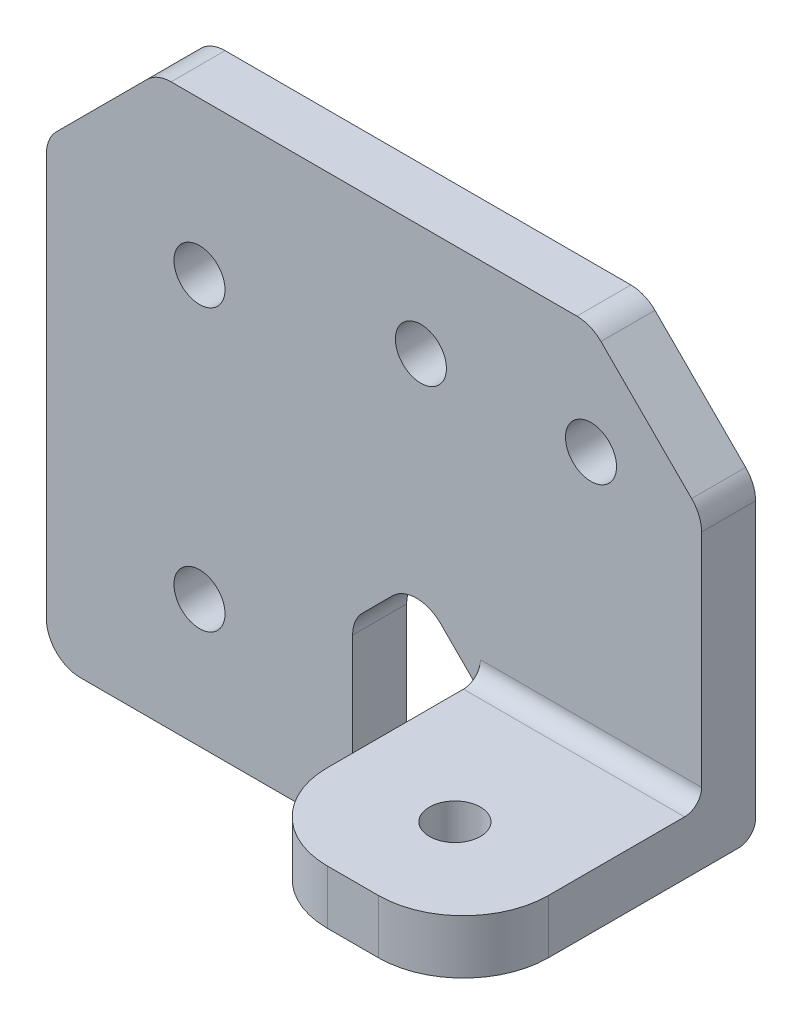
ISO-10303-21;
HEADER;
FILE_DESCRIPTION(('STEP AP214'),'2;1');
FILE_NAME('part.step','',(''),(''),'','','');
FILE_SCHEMA(('AUTOMOTIVE_DESIGN { 1 0 10303 214 1 1 1 1 }'));
ENDSEC;
DATA;
#1=APPLICATION_CONTEXT('core data for automotive mechanical design processes');
#2=APPLICATION_PROTOCOL_DEFINITION('international standard','automotive_design',2000,#1);
#3=PRODUCT_CONTEXT('',#1,'mechanical');
#4=PRODUCT('Part','Part','',(#3));
#5=PRODUCT_RELATED_PRODUCT_CATEGORY('part','',(#4));
#6=PRODUCT_DEFINITION_FORMATION('','',#4);
#7=PRODUCT_DEFINITION_CONTEXT('part definition',#1,'design');
#8=PRODUCT_DEFINITION('design','',#6,#7);
#9=PRODUCT_DEFINITION_SHAPE('','',#8);
#10=(LENGTH_UNIT() NAMED_UNIT(*) SI_UNIT(.MILLI.,.METRE.));
#11=(NAMED_UNIT(*) PLANE_ANGLE_UNIT() SI_UNIT($,.RADIAN.));
#12=(NAMED_UNIT(*) SI_UNIT($,.STERADIAN.) SOLID_ANGLE_UNIT());
#13=UNCERTAINTY_MEASURE_WITH_UNIT(LENGTH_MEASURE(1.E-05),#10,'distance_accuracy_value','');
#14=(GEOMETRIC_REPRESENTATION_CONTEXT(3) GLOBAL_UNCERTAINTY_ASSIGNED_CONTEXT((#13)) GLOBAL_UNIT_ASSIGNED_CONTEXT((#10,
#11,#12)) REPRESENTATION_CONTEXT('',''));
#15=CARTESIAN_POINT('',(0.,0.,0.));
#16=DIRECTION('',(0.,0.,1.));
#17=DIRECTION('',(1.,0.,0.));
#18=AXIS2_PLACEMENT_3D('',#15,#16,#17);
#19=CARTESIAN_POINT('',(6.5,36.,3.175));
#20=DIRECTION('',(1.,0.,0.));
#21=DIRECTION('',(0.,0.,-1.));
#22=AXIS2_PLACEMENT_3D('',#19,#20,#21);
#23=PLANE('',#22);
#24=DIRECTION('',(0.,1.,0.));
#25=VECTOR('',#24,1.);
#26=CARTESIAN_POINT('',(6.5,36.,3.175));
#27=LINE('',#26,#25);
#28=CARTESIAN_POINT('',(6.5,22.175,3.175));
#29=VERTEX_POINT('',#28);
#30=CARTESIAN_POINT('',(6.5,35.1715728752538,3.175));
#31=VERTEX_POINT('',#30);
#32=EDGE_CURVE('E490',#29,#31,#27,.T.);
#33=ORIENTED_EDGE('',*,*,#32,.F.);
#34=CARTESIAN_POINT('',(6.5,22.175,4.175));
#35=DIRECTION('',(-1.,0.,0.));
#36=DIRECTION('',(0.,0.,-1.));
#37=AXIS2_PLACEMENT_3D('',#34,#35,#36);
#38=CIRCLE('',#37,1.);
#39=CARTESIAN_POINT('',(6.5,21.175,4.175));
#40=VERTEX_POINT('',#39);
#41=EDGE_CURVE('E282',#40,#29,#38,.F.);
#42=ORIENTED_EDGE('',*,*,#41,.F.);
#43=DIRECTION('',(0.,0.,-1.));
#44=VECTOR('',#43,1.);
#45=CARTESIAN_POINT('',(6.5,21.175,17.175));
#46=LINE('',#45,#44);
#47=CARTESIAN_POINT('',(6.5,21.175,12.175));
#48=VERTEX_POINT('',#47);
#49=EDGE_CURVE('E479',#48,#40,#46,.T.);
#50=ORIENTED_EDGE('',*,*,#49,.F.);
#51=DIRECTION('',(0.,-1.,0.));
#52=VECTOR('',#51,1.);
#53=CARTESIAN_POINT('',(6.5,36.,12.175));
#54=LINE('',#53,#52);
#55=CARTESIAN_POINT('',(6.5,18.,12.175));
#56=VERTEX_POINT('',#55);
#57=EDGE_CURVE('E257',#56,#48,#54,.F.);
#58=ORIENTED_EDGE('',*,*,#57,.F.);
#59=DIRECTION('',(0.,0.,-1.));
#60=VECTOR('',#59,1.);
#61=CARTESIAN_POINT('',(6.5,18.,3.175));
#62=LINE('',#61,#60);
#63=CARTESIAN_POINT('',(6.5,18.,1.));
#64=VERTEX_POINT('',#63);
#65=EDGE_CURVE('E509',#56,#64,#62,.T.);
#66=ORIENTED_EDGE('',*,*,#65,.T.);
#67=CARTESIAN_POINT('',(6.5,19.,1.));
#68=DIRECTION('',(-1.,0.,0.));
#69=DIRECTION('',(0.,0.,-1.));
#70=AXIS2_PLACEMENT_3D('',#67,#68,#69);
#71=CIRCLE('',#70,1.);
#72=CARTESIAN_POINT('',(6.5,19.,0.));
#73=VERTEX_POINT('',#72);
#74=EDGE_CURVE('E264',#73,#64,#71,.T.);
#75=ORIENTED_EDGE('',*,*,#74,.F.);
#76=DIRECTION('',(0.,1.,0.));
#77=VECTOR('',#76,1.);
#78=CARTESIAN_POINT('',(6.5,36.,0.));
#79=LINE('',#78,#77);
#80=CARTESIAN_POINT('',(6.5,35.1715728752538,0.));
#81=VERTEX_POINT('',#80);
#82=EDGE_CURVE('E499',#73,#81,#79,.T.);
#83=ORIENTED_EDGE('',*,*,#82,.T.);
#84=DIRECTION('',(0.,0.,-1.));
#85=VECTOR('',#84,1.);
#86=CARTESIAN_POINT('',(6.5,35.1715728752538,0.));
#87=LINE('',#86,#85);
#88=EDGE_CURVE('E333',#31,#81,#87,.T.);
#89=ORIENTED_EDGE('',*,*,#88,.F.);
#90=EDGE_LOOP('',(#33,#42,#50,#58,#66,#75,#83,#89));
#91=FACE_BOUND('',#90,.T.);
#92=ADVANCED_FACE('F43',(#91),#23,.T.);
#93=CARTESIAN_POINT('',(0.,18.,3.175));
#94=DIRECTION('',(0.,-1.,0.));
#95=DIRECTION('',(0.,0.,1.));
#96=AXIS2_PLACEMENT_3D('',#93,#94,#95);
#97=PLANE('',#96);
#98=CARTESIAN_POINT('',(0.,18.,11.175));
#99=DIRECTION('',(0.,1.,0.));
#100=DIRECTION('',(0.,0.,1.));
#101=AXIS2_PLACEMENT_3D('',#98,#99,#100);
#102=CIRCLE('',#101,1.5);
#103=CARTESIAN_POINT('',(0.,18.,12.675));
#104=VERTEX_POINT('',#103);
#105=EDGE_CURVE('E470',#104,#104,#102,.T.);
#106=ORIENTED_EDGE('',*,*,#105,.T.);
#107=EDGE_LOOP('',(#106));
#108=FACE_BOUND('',#107,.T.);
#109=ORIENTED_EDGE('',*,*,#65,.F.);
#110=CARTESIAN_POINT('',(1.5,18.,12.175));
#111=DIRECTION('',(0.,1.,0.));
#112=DIRECTION('',(0.,0.,1.));
#113=AXIS2_PLACEMENT_3D('',#110,#111,#112);
#114=CIRCLE('',#113,5.);
#115=CARTESIAN_POINT('',(1.5,18.,17.175));
#116=VERTEX_POINT('',#115);
#117=EDGE_CURVE('E249',#116,#56,#114,.T.);
#118=ORIENTED_EDGE('',*,*,#117,.F.);
#119=DIRECTION('',(-1.,0.,0.));
#120=VECTOR('',#119,1.);
#121=CARTESIAN_POINT('',(-6.5,18.,17.175));
#122=LINE('',#121,#120);
#123=CARTESIAN_POINT('',(-1.5,18.,17.175));
#124=VERTEX_POINT('',#123);
#125=EDGE_CURVE('E237',#116,#124,#122,.T.);
#126=ORIENTED_EDGE('',*,*,#125,.T.);
#127=CARTESIAN_POINT('',(-1.5,18.,12.175));
#128=DIRECTION('',(0.,1.,0.));
#129=DIRECTION('',(0.,0.,1.));
#130=AXIS2_PLACEMENT_3D('',#127,#128,#129);
#131=CIRCLE('',#130,5.);
#132=CARTESIAN_POINT('',(-6.5,18.,12.175));
#133=VERTEX_POINT('',#132);
#134=EDGE_CURVE('E223',#133,#124,#131,.T.);
#135=ORIENTED_EDGE('',*,*,#134,.F.);
#136=DIRECTION('',(0.,0.,-1.));
#137=VECTOR('',#136,1.);
#138=CARTESIAN_POINT('',(-6.5,18.,3.175));
#139=LINE('',#138,#137);
#140=CARTESIAN_POINT('',(-6.5,18.,1.));
#141=VERTEX_POINT('',#140);
#142=EDGE_CURVE('E495',#133,#141,#139,.T.);
#143=ORIENTED_EDGE('',*,*,#142,.T.);
#144=DIRECTION('',(1.,0.,0.));
#145=VECTOR('',#144,1.);
#146=CARTESIAN_POINT('',(-6.5,18.,1.));
#147=LINE('',#146,#145);
#148=EDGE_CURVE('E268',#64,#141,#147,.F.);
#149=ORIENTED_EDGE('',*,*,#148,.F.);
#150=EDGE_LOOP('',(#109,#118,#126,#135,#143,#149));
#151=FACE_BOUND('',#150,.T.);
#152=ADVANCED_FACE('F522',(#108,#151),#97,.T.);
#153=CARTESIAN_POINT('',(0.,36.,3.175));
#154=DIRECTION('',(0.,0.,-1.));
#155=DIRECTION('',(-1.,0.,0.));
#156=AXIS2_PLACEMENT_3D('',#153,#154,#155);
#157=CYLINDRICAL_SURFACE('',#156,1.5);
#158=CARTESIAN_POINT('',(0.,36.,3.175));
#159=DIRECTION('',(0.,0.,-1.));
#160=DIRECTION('',(1.,0.,0.));
#161=AXIS2_PLACEMENT_3D('',#158,#159,#160);
#162=CIRCLE('',#161,1.5);
#163=CARTESIAN_POINT('',(1.5,36.,3.175));
#164=VERTEX_POINT('',#163);
#165=EDGE_CURVE('E486',#164,#164,#162,.T.);
#166=ORIENTED_EDGE('',*,*,#165,.F.);
#167=EDGE_LOOP('',(#166));
#168=FACE_BOUND('',#167,.T.);
#169=CARTESIAN_POINT('',(0.,36.,0.));
#170=DIRECTION('',(0.,0.,-1.));
#171=DIRECTION('',(1.,0.,0.));
#172=AXIS2_PLACEMENT_3D('',#169,#170,#171);
#173=CIRCLE('',#172,1.5);
#174=CARTESIAN_POINT('',(1.5,36.,0.));
#175=VERTEX_POINT('',#174);
#176=EDGE_CURVE('E485',#175,#175,#173,.T.);
#177=ORIENTED_EDGE('',*,*,#176,.T.);
#178=EDGE_LOOP('',(#177));
#179=FACE_BOUND('',#178,.T.);
#180=ADVANCED_FACE('F618',(#168,#179),#157,.F.);
#181=CARTESIAN_POINT('',(-6.5,36.,3.175));
#182=DIRECTION('',(-1.,0.,0.));
#183=DIRECTION('',(0.,0.,1.));
#184=AXIS2_PLACEMENT_3D('',#181,#182,#183);
#185=PLANE('',#184);
#186=DIRECTION('',(0.,-1.,0.));
#187=VECTOR('',#186,1.);
#188=CARTESIAN_POINT('',(-6.5,36.,0.));
#189=LINE('',#188,#187);
#190=CARTESIAN_POINT('',(-6.5,19.6715728752538,0.));
#191=VERTEX_POINT('',#190);
#192=CARTESIAN_POINT('',(-6.5,19.,0.));
#193=VERTEX_POINT('',#192);
#194=EDGE_CURVE('E491',#191,#193,#189,.T.);
#195=ORIENTED_EDGE('',*,*,#194,.T.);
#196=CARTESIAN_POINT('',(-6.5,19.,1.));
#197=DIRECTION('',(1.,0.,0.));
#198=DIRECTION('',(0.,0.,1.));
#199=AXIS2_PLACEMENT_3D('',#196,#197,#198);
#200=CIRCLE('',#199,1.);
#201=EDGE_CURVE('E272',#141,#193,#200,.T.);
#202=ORIENTED_EDGE('',*,*,#201,.F.);
#203=ORIENTED_EDGE('',*,*,#142,.F.);
#204=DIRECTION('',(0.,1.,0.));
#205=VECTOR('',#204,1.);
#206=CARTESIAN_POINT('',(-6.5,36.,12.175));
#207=LINE('',#206,#205);
#208=CARTESIAN_POINT('',(-6.5,21.175,12.175));
#209=VERTEX_POINT('',#208);
#210=EDGE_CURVE('E245',#209,#133,#207,.F.);
#211=ORIENTED_EDGE('',*,*,#210,.F.);
#212=DIRECTION('',(0.,0.,-1.));
#213=VECTOR('',#212,1.);
#214=CARTESIAN_POINT('',(-6.5,21.175,17.175));
#215=LINE('',#214,#213);
#216=CARTESIAN_POINT('',(-6.5,21.175,4.175));
#217=VERTEX_POINT('',#216);
#218=EDGE_CURVE('E242',#209,#217,#215,.T.);
#219=ORIENTED_EDGE('',*,*,#218,.T.);
#220=CARTESIAN_POINT('',(-6.5,22.175,4.175));
#221=DIRECTION('',(1.,0.,0.));
#222=DIRECTION('',(0.,0.,1.));
#223=AXIS2_PLACEMENT_3D('',#220,#221,#222);
#224=CIRCLE('',#223,1.);
#225=CARTESIAN_POINT('',(-6.5,22.175,3.175));
#226=VERTEX_POINT('',#225);
#227=EDGE_CURVE('E286',#226,#217,#224,.F.);
#228=ORIENTED_EDGE('',*,*,#227,.F.);
#229=DIRECTION('',(0.,1.,0.));
#230=VECTOR('',#229,1.);
#231=CARTESIAN_POINT('',(-6.5,36.,3.175));
#232=LINE('',#231,#230);
#233=CARTESIAN_POINT('',(-6.5,19.6715728752538,3.175));
#234=VERTEX_POINT('',#233);
#235=EDGE_CURVE('E290',#234,#226,#232,.T.);
#236=ORIENTED_EDGE('',*,*,#235,.F.);
#237=DIRECTION('',(0.,0.,-1.));
#238=VECTOR('',#237,1.);
#239=CARTESIAN_POINT('',(-6.5,19.6715728752538,3.175));
#240=LINE('',#239,#238);
#241=EDGE_CURVE('E305',#191,#234,#240,.F.);
#242=ORIENTED_EDGE('',*,*,#241,.F.);
#243=EDGE_LOOP('',(#195,#202,#203,#211,#219,#228,#236,#242));
#244=FACE_BOUND('',#243,.T.);
#245=ADVANCED_FACE('F534',(#244),#185,.T.);
#246=CARTESIAN_POINT('',(0.,36.,3.175));
#247=DIRECTION('',(0.,0.,1.));
#248=DIRECTION('',(1.,0.,0.));
#249=AXIS2_PLACEMENT_3D('',#246,#247,#248);
#250=PLANE('',#249);
#251=CARTESIAN_POINT('',(-23.0129229130923,33.5,3.175));
#252=DIRECTION('',(0.,0.,1.));
#253=DIRECTION('',(-1.,0.,0.));
#254=AXIS2_PLACEMENT_3D('',#251,#252,#253);
#255=CIRCLE('',#254,1.5);
#256=CARTESIAN_POINT('',(-24.5129229130923,33.5,3.175));
#257=VERTEX_POINT('',#256);
#258=EDGE_CURVE('E447',#257,#257,#255,.T.);
#259=ORIENTED_EDGE('',*,*,#258,.F.);
#260=EDGE_LOOP('',(#259));
#261=FACE_BOUND('',#260,.T.);
#262=CARTESIAN_POINT('',(-23.0129229130923,17.,3.175));
#263=DIRECTION('',(0.,0.,-1.));
#264=DIRECTION('',(1.,0.,0.));
#265=AXIS2_PLACEMENT_3D('',#262,#263,#264);
#266=CIRCLE('',#265,1.5);
#267=CARTESIAN_POINT('',(-21.5129229130923,17.,3.175));
#268=VERTEX_POINT('',#267);
#269=EDGE_CURVE('E684',#268,#268,#266,.T.);
#270=ORIENTED_EDGE('',*,*,#269,.T.);
#271=EDGE_LOOP('',(#270));
#272=FACE_BOUND('',#271,.T.);
#273=DIRECTION('',(0.,-1.,0.));
#274=VECTOR('',#273,1.);
#275=CARTESIAN_POINT('',(-32.0129229130922,36.,3.175));
#276=LINE('',#275,#274);
#277=CARTESIAN_POINT('',(-32.0129229130922,35.1715728752538,3.175));
#278=VERTEX_POINT('',#277);
#279=CARTESIAN_POINT('',(-32.0129229130922,11.5,3.175));
#280=VERTEX_POINT('',#279);
#281=EDGE_CURVE('E446',#278,#280,#276,.T.);
#282=ORIENTED_EDGE('',*,*,#281,.T.);
#283=CARTESIAN_POINT('',(-30.0129229130922,11.5,3.175));
#284=DIRECTION('',(0.,0.,-1.));
#285=DIRECTION('',(1.,0.,0.));
#286=AXIS2_PLACEMENT_3D('',#283,#284,#285);
#287=CIRCLE('',#286,2.);
#288=CARTESIAN_POINT('',(-30.0129229130922,9.49999999999996,3.175));
#289=VERTEX_POINT('',#288);
#290=EDGE_CURVE('E373',#289,#280,#287,.T.);
#291=ORIENTED_EDGE('',*,*,#290,.F.);
#292=DIRECTION('',(-1.,0.,0.));
#293=VECTOR('',#292,1.);
#294=CARTESIAN_POINT('',(0.,9.49999999999996,3.175));
#295=LINE('',#294,#293);
#296=CARTESIAN_POINT('',(-16.0129229130923,9.49999999999996,3.175));
#297=VERTEX_POINT('',#296);
#298=EDGE_CURVE('E681',#297,#289,#295,.T.);
#299=ORIENTED_EDGE('',*,*,#298,.F.);
#300=CARTESIAN_POINT('',(-16.0129229130923,11.5,3.175));
#301=DIRECTION('',(0.,0.,-1.));
#302=DIRECTION('',(1.,0.,0.));
#303=AXIS2_PLACEMENT_3D('',#300,#301,#302);
#304=CIRCLE('',#303,2.);
#305=CARTESIAN_POINT('',(-14.0129229130923,11.5,3.175));
#306=VERTEX_POINT('',#305);
#307=EDGE_CURVE('E369',#306,#297,#304,.T.);
#308=ORIENTED_EDGE('',*,*,#307,.F.);
#309=DIRECTION('',(0.,-1.,0.));
#310=VECTOR('',#309,1.);
#311=CARTESIAN_POINT('',(-14.0129229130923,36.,3.175));
#312=LINE('',#311,#310);
#313=CARTESIAN_POINT('',(-14.0129229130923,19.6715728752537,3.175));
#314=VERTEX_POINT('',#313);
#315=EDGE_CURVE('E589',#314,#306,#312,.T.);
#316=ORIENTED_EDGE('',*,*,#315,.F.);
#317=CARTESIAN_POINT('',(-12.0129229130923,19.6715728752537,3.175));
#318=DIRECTION('',(0.,0.,-1.));
#319=DIRECTION('',(1.,0.,0.));
#320=AXIS2_PLACEMENT_3D('',#317,#318,#319);
#321=CIRCLE('',#320,2.);
#322=CARTESIAN_POINT('',(-13.4271364754654,21.0857864376268,3.175));
#323=VERTEX_POINT('',#322);
#324=EDGE_CURVE('E396',#323,#314,#321,.F.);
#325=ORIENTED_EDGE('',*,*,#324,.F.);
#326=DIRECTION('',(-0.707106781186551,-0.707106781186544,0.));
#327=VECTOR('',#326,1.);
#328=CARTESIAN_POINT('',(-10.0129229130922,24.5,3.175));
#329=LINE('',#328,#327);
#330=CARTESIAN_POINT('',(-11.6706750189192,22.842247894173,3.175));
#331=VERTEX_POINT('',#330);
#332=EDGE_CURVE('E344',#331,#323,#329,.T.);
#333=ORIENTED_EDGE('',*,*,#332,.F.);
#334=CARTESIAN_POINT('',(-10.2564614565461,21.4280343317999,3.175));
#335=DIRECTION('',(0.,0.,-1.));
#336=DIRECTION('',(1.,0.,0.));
#337=AXIS2_PLACEMENT_3D('',#334,#335,#336);
#338=CIRCLE('',#337,2.);
#339=CARTESIAN_POINT('',(-8.84224789417304,22.842247894173,3.175));
#340=VERTEX_POINT('',#339);
#341=EDGE_CURVE('E400',#340,#331,#338,.F.);
#342=ORIENTED_EDGE('',*,*,#341,.F.);
#343=DIRECTION('',(0.707106781186551,-0.707106781186544,0.));
#344=VECTOR('',#343,1.);
#345=CARTESIAN_POINT('',(-10.5,24.5,3.175));
#346=LINE('',#345,#344);
#347=CARTESIAN_POINT('',(-7.08578643762691,21.0857864376269,3.175));
#348=VERTEX_POINT('',#347);
#349=EDGE_CURVE('E298',#348,#340,#346,.F.);
#350=ORIENTED_EDGE('',*,*,#349,.F.);
#351=CARTESIAN_POINT('',(-8.5,19.6715728752538,3.175));
#352=DIRECTION('',(0.,0.,-1.));
#353=DIRECTION('',(1.,0.,0.));
#354=AXIS2_PLACEMENT_3D('',#351,#352,#353);
#355=CIRCLE('',#354,2.);
#356=EDGE_CURVE('E337',#234,#348,#355,.F.);
#357=ORIENTED_EDGE('',*,*,#356,.F.);
#358=ORIENTED_EDGE('',*,*,#235,.T.);
#359=DIRECTION('',(1.,0.,0.));
#360=VECTOR('',#359,1.);
#361=CARTESIAN_POINT('',(0.,22.175,3.175));
#362=LINE('',#361,#360);
#363=EDGE_CURVE('E279',#29,#226,#362,.F.);
#364=ORIENTED_EDGE('',*,*,#363,.F.);
#365=ORIENTED_EDGE('',*,*,#32,.T.);
#366=CARTESIAN_POINT('',(4.5,35.1715728752538,3.175));
#367=DIRECTION('',(0.,0.,-1.));
#368=DIRECTION('',(1.,0.,0.));
#369=AXIS2_PLACEMENT_3D('',#366,#367,#368);
#370=CIRCLE('',#369,2.);
#371=CARTESIAN_POINT('',(5.9142135623731,36.5857864376269,3.175));
#372=VERTEX_POINT('',#371);
#373=EDGE_CURVE('E326',#372,#31,#370,.T.);
#374=ORIENTED_EDGE('',*,*,#373,.F.);
#375=DIRECTION('',(-0.707106781186548,0.707106781186548,0.));
#376=VECTOR('',#375,1.);
#377=CARTESIAN_POINT('',(3.25,39.25,3.175));
#378=LINE('',#377,#376);
#379=CARTESIAN_POINT('',(0.585786437626904,41.9142135623731,3.175));
#380=VERTEX_POINT('',#379);
#381=EDGE_CURVE('E555',#372,#380,#378,.T.);
#382=ORIENTED_EDGE('',*,*,#381,.T.);
#383=CARTESIAN_POINT('',(-0.82842712474619,40.5,3.175));
#384=DIRECTION('',(0.,0.,-1.));
#385=DIRECTION('',(1.,0.,0.));
#386=AXIS2_PLACEMENT_3D('',#383,#384,#385);
#387=CIRCLE('',#386,2.);
#388=CARTESIAN_POINT('',(-0.82842712474619,42.5,3.175));
#389=VERTEX_POINT('',#388);
#390=EDGE_CURVE('E329',#389,#380,#387,.T.);
#391=ORIENTED_EDGE('',*,*,#390,.F.);
#392=DIRECTION('',(-1.,0.,0.));
#393=VECTOR('',#392,1.);
#394=CARTESIAN_POINT('',(0.,42.5,3.175));
#395=LINE('',#394,#393);
#396=CARTESIAN_POINT('',(-24.6844957883461,42.5,3.175));
#397=VERTEX_POINT('',#396);
#398=EDGE_CURVE('E452',#389,#397,#395,.T.);
#399=ORIENTED_EDGE('',*,*,#398,.T.);
#400=CARTESIAN_POINT('',(-24.6844957883461,40.5,3.175));
#401=DIRECTION('',(0.,0.,-1.));
#402=DIRECTION('',(1.,0.,0.));
#403=AXIS2_PLACEMENT_3D('',#400,#401,#402);
#404=CIRCLE('',#403,2.);
#405=CARTESIAN_POINT('',(-26.0987093507192,41.9142135623731,3.175));
#406=VERTEX_POINT('',#405);
#407=EDGE_CURVE('E419',#406,#397,#404,.T.);
#408=ORIENTED_EDGE('',*,*,#407,.F.);
#409=DIRECTION('',(-0.707106781186547,-0.707106781186548,0.));
#410=VECTOR('',#409,1.);
#411=CARTESIAN_POINT('',(-16.0064614565462,52.0064614565461,3.175));
#412=LINE('',#411,#410);
#413=CARTESIAN_POINT('',(-31.4271364754653,36.5857864376269,3.175));
#414=VERTEX_POINT('',#413);
#415=EDGE_CURVE('E412',#414,#406,#412,.F.);
#416=ORIENTED_EDGE('',*,*,#415,.F.);
#417=CARTESIAN_POINT('',(-30.0129229130922,35.1715728752538,3.175));
#418=DIRECTION('',(0.,0.,-1.));
#419=DIRECTION('',(1.,0.,0.));
#420=AXIS2_PLACEMENT_3D('',#417,#418,#419);
#421=CIRCLE('',#420,2.);
#422=EDGE_CURVE('E422',#278,#414,#421,.T.);
#423=ORIENTED_EDGE('',*,*,#422,.F.);
#424=EDGE_LOOP('',(#282,#291,#299,#308,#316,#325,#333,#342,#350,#357,#358,#364,#365,#374,#382,
#391,#399,#408,#416,#423));
#425=FACE_BOUND('',#424,.T.);
#426=CARTESIAN_POINT('',(-10.,36.,3.175));
#427=DIRECTION('',(0.,0.,-1.));
#428=DIRECTION('',(1.,0.,0.));
#429=AXIS2_PLACEMENT_3D('',#426,#427,#428);
#430=CIRCLE('',#429,1.5);
#431=CARTESIAN_POINT('',(-8.5,36.,3.175));
#432=VERTEX_POINT('',#431);
#433=EDGE_CURVE('E466',#432,#432,#430,.F.);
#434=ORIENTED_EDGE('',*,*,#433,.F.);
#435=EDGE_LOOP('',(#434));
#436=FACE_BOUND('',#435,.T.);
#437=ORIENTED_EDGE('',*,*,#165,.T.);
#438=EDGE_LOOP('',(#437));
#439=FACE_BOUND('',#438,.T.);
#440=ADVANCED_FACE('F552',(#261,#272,#425,#436,#439),#250,.T.);
#441=CARTESIAN_POINT('',(0.,36.,0.));
#442=DIRECTION('',(0.,0.,1.));
#443=DIRECTION('',(1.,0.,0.));
#444=AXIS2_PLACEMENT_3D('',#441,#442,#443);
#445=PLANE('',#444);
#446=CARTESIAN_POINT('',(-23.0129229130923,33.5,0.));
#447=DIRECTION('',(0.,0.,1.));
#448=DIRECTION('',(-1.,0.,0.));
#449=AXIS2_PLACEMENT_3D('',#446,#447,#448);
#450=CIRCLE('',#449,1.5);
#451=CARTESIAN_POINT('',(-24.5129229130923,33.5,0.));
#452=VERTEX_POINT('',#451);
#453=EDGE_CURVE('E455',#452,#452,#450,.T.);
#454=ORIENTED_EDGE('',*,*,#453,.T.);
#455=EDGE_LOOP('',(#454));
#456=FACE_BOUND('',#455,.T.);
#457=CARTESIAN_POINT('',(-23.0129229130923,17.,0.));
#458=DIRECTION('',(0.,0.,1.));
#459=DIRECTION('',(-1.,0.,0.));
#460=AXIS2_PLACEMENT_3D('',#457,#458,#459);
#461=CIRCLE('',#460,1.5);
#462=CARTESIAN_POINT('',(-24.5129229130923,17.,0.));
#463=VERTEX_POINT('',#462);
#464=EDGE_CURVE('E689',#463,#463,#461,.T.);
#465=ORIENTED_EDGE('',*,*,#464,.T.);
#466=EDGE_LOOP('',(#465));
#467=FACE_BOUND('',#466,.T.);
#468=DIRECTION('',(0.707106781186547,0.707106781186548,0.));
#469=VECTOR('',#468,1.);
#470=CARTESIAN_POINT('',(-25.5129229130923,42.5,0.));
#471=LINE('',#470,#469);
#472=CARTESIAN_POINT('',(-26.0987093507192,41.9142135623731,0.));
#473=VERTEX_POINT('',#472);
#474=CARTESIAN_POINT('',(-31.4271364754653,36.5857864376269,0.));
#475=VERTEX_POINT('',#474);
#476=EDGE_CURVE('E408',#473,#475,#471,.F.);
#477=ORIENTED_EDGE('',*,*,#476,.F.);
#478=CARTESIAN_POINT('',(-24.6844957883461,40.5,0.));
#479=DIRECTION('',(0.,0.,-1.));
#480=DIRECTION('',(1.,0.,0.));
#481=AXIS2_PLACEMENT_3D('',#478,#479,#480);
#482=CIRCLE('',#481,2.);
#483=CARTESIAN_POINT('',(-24.6844957883461,42.5,0.));
#484=VERTEX_POINT('',#483);
#485=EDGE_CURVE('E430',#484,#473,#482,.F.);
#486=ORIENTED_EDGE('',*,*,#485,.F.);
#487=DIRECTION('',(-1.,0.,0.));
#488=VECTOR('',#487,1.);
#489=CARTESIAN_POINT('',(0.,42.5,0.));
#490=LINE('',#489,#488);
#491=CARTESIAN_POINT('',(-0.82842712474619,42.5,0.));
#492=VERTEX_POINT('',#491);
#493=EDGE_CURVE('E463',#492,#484,#490,.T.);
#494=ORIENTED_EDGE('',*,*,#493,.F.);
#495=CARTESIAN_POINT('',(-0.82842712474619,40.5,0.));
#496=DIRECTION('',(0.,0.,-1.));
#497=DIRECTION('',(1.,0.,0.));
#498=AXIS2_PLACEMENT_3D('',#495,#496,#497);
#499=CIRCLE('',#498,2.);
#500=CARTESIAN_POINT('',(0.585786437626904,41.9142135623731,0.));
#501=VERTEX_POINT('',#500);
#502=EDGE_CURVE('E319',#501,#492,#499,.F.);
#503=ORIENTED_EDGE('',*,*,#502,.F.);
#504=DIRECTION('',(0.707106781186548,-0.707106781186548,0.));
#505=VECTOR('',#504,1.);
#506=CARTESIAN_POINT('',(6.5,36.,0.));
#507=LINE('',#506,#505);
#508=CARTESIAN_POINT('',(5.9142135623731,36.5857864376269,0.));
#509=VERTEX_POINT('',#508);
#510=EDGE_CURVE('E545',#501,#509,#507,.T.);
#511=ORIENTED_EDGE('',*,*,#510,.T.);
#512=CARTESIAN_POINT('',(4.5,35.1715728752538,0.));
#513=DIRECTION('',(0.,0.,-1.));
#514=DIRECTION('',(1.,0.,0.));
#515=AXIS2_PLACEMENT_3D('',#512,#513,#514);
#516=CIRCLE('',#515,2.);
#517=EDGE_CURVE('E315',#81,#509,#516,.F.);
#518=ORIENTED_EDGE('',*,*,#517,.F.);
#519=ORIENTED_EDGE('',*,*,#82,.F.);
#520=DIRECTION('',(1.,0.,0.));
#521=VECTOR('',#520,1.);
#522=CARTESIAN_POINT('',(6.5,19.,0.));
#523=LINE('',#522,#521);
#524=EDGE_CURVE('E261',#193,#73,#523,.T.);
#525=ORIENTED_EDGE('',*,*,#524,.F.);
#526=ORIENTED_EDGE('',*,*,#194,.F.);
#527=CARTESIAN_POINT('',(-8.5,19.6715728752538,0.));
#528=DIRECTION('',(0.,0.,-1.));
#529=DIRECTION('',(1.,0.,0.));
#530=AXIS2_PLACEMENT_3D('',#527,#528,#529);
#531=CIRCLE('',#530,2.);
#532=CARTESIAN_POINT('',(-7.08578643762691,21.0857864376269,0.));
#533=VERTEX_POINT('',#532);
#534=EDGE_CURVE('E341',#533,#191,#531,.T.);
#535=ORIENTED_EDGE('',*,*,#534,.F.);
#536=DIRECTION('',(-0.707106781186551,0.707106781186544,0.));
#537=VECTOR('',#536,1.);
#538=CARTESIAN_POINT('',(-11.,24.9999999999999,0.));
#539=LINE('',#538,#537);
#540=CARTESIAN_POINT('',(-8.84224789417304,22.842247894173,0.));
#541=VERTEX_POINT('',#540);
#542=EDGE_CURVE('E294',#541,#533,#539,.F.);
#543=ORIENTED_EDGE('',*,*,#542,.F.);
#544=CARTESIAN_POINT('',(-10.2564614565461,21.4280343317999,0.));
#545=DIRECTION('',(0.,0.,-1.));
#546=DIRECTION('',(1.,0.,0.));
#547=AXIS2_PLACEMENT_3D('',#544,#545,#546);
#548=CIRCLE('',#547,2.);
#549=CARTESIAN_POINT('',(-11.6706750189192,22.842247894173,0.));
#550=VERTEX_POINT('',#549);
#551=EDGE_CURVE('E404',#550,#541,#548,.T.);
#552=ORIENTED_EDGE('',*,*,#551,.F.);
#553=DIRECTION('',(0.707106781186551,0.707106781186544,0.));
#554=VECTOR('',#553,1.);
#555=CARTESIAN_POINT('',(0.743538543453953,35.256461456546,0.));
#556=LINE('',#555,#554);
#557=CARTESIAN_POINT('',(-13.4271364754654,21.0857864376268,0.));
#558=VERTEX_POINT('',#557);
#559=EDGE_CURVE('E348',#558,#550,#556,.T.);
#560=ORIENTED_EDGE('',*,*,#559,.F.);
#561=CARTESIAN_POINT('',(-12.0129229130923,19.6715728752537,0.));
#562=DIRECTION('',(0.,0.,-1.));
#563=DIRECTION('',(1.,0.,0.));
#564=AXIS2_PLACEMENT_3D('',#561,#562,#563);
#565=CIRCLE('',#564,2.);
#566=CARTESIAN_POINT('',(-14.0129229130923,19.6715728752537,0.));
#567=VERTEX_POINT('',#566);
#568=EDGE_CURVE('E392',#567,#558,#565,.T.);
#569=ORIENTED_EDGE('',*,*,#568,.F.);
#570=DIRECTION('',(0.,-1.,0.));
#571=VECTOR('',#570,1.);
#572=CARTESIAN_POINT('',(-14.0129229130923,36.,0.));
#573=LINE('',#572,#571);
#574=CARTESIAN_POINT('',(-14.0129229130923,11.5,0.));
#575=VERTEX_POINT('',#574);
#576=EDGE_CURVE('E580',#567,#575,#573,.T.);
#577=ORIENTED_EDGE('',*,*,#576,.T.);
#578=CARTESIAN_POINT('',(-16.0129229130923,11.5,0.));
#579=DIRECTION('',(0.,0.,-1.));
#580=DIRECTION('',(1.,0.,0.));
#581=AXIS2_PLACEMENT_3D('',#578,#579,#580);
#582=CIRCLE('',#581,2.);
#583=CARTESIAN_POINT('',(-16.0129229130923,9.49999999999996,0.));
#584=VERTEX_POINT('',#583);
#585=EDGE_CURVE('E355',#584,#575,#582,.F.);
#586=ORIENTED_EDGE('',*,*,#585,.F.);
#587=DIRECTION('',(-1.,0.,0.));
#588=VECTOR('',#587,1.);
#589=CARTESIAN_POINT('',(0.,9.49999999999996,0.));
#590=LINE('',#589,#588);
#591=CARTESIAN_POINT('',(-30.0129229130922,9.49999999999996,0.));
#592=VERTEX_POINT('',#591);
#593=EDGE_CURVE('E584',#584,#592,#590,.T.);
#594=ORIENTED_EDGE('',*,*,#593,.T.);
#595=CARTESIAN_POINT('',(-30.0129229130922,11.5,0.));
#596=DIRECTION('',(0.,0.,-1.));
#597=DIRECTION('',(1.,0.,0.));
#598=AXIS2_PLACEMENT_3D('',#595,#596,#597);
#599=CIRCLE('',#598,2.);
#600=CARTESIAN_POINT('',(-32.0129229130922,11.5,0.));
#601=VERTEX_POINT('',#600);
#602=EDGE_CURVE('E359',#601,#592,#599,.F.);
#603=ORIENTED_EDGE('',*,*,#602,.F.);
#604=DIRECTION('',(0.,-1.,0.));
#605=VECTOR('',#604,1.);
#606=CARTESIAN_POINT('',(-32.0129229130922,36.,0.));
#607=LINE('',#606,#605);
#608=CARTESIAN_POINT('',(-32.0129229130922,35.1715728752538,0.));
#609=VERTEX_POINT('',#608);
#610=EDGE_CURVE('E440',#609,#601,#607,.T.);
#611=ORIENTED_EDGE('',*,*,#610,.F.);
#612=CARTESIAN_POINT('',(-30.0129229130922,35.1715728752538,0.));
#613=DIRECTION('',(0.,0.,-1.));
#614=DIRECTION('',(1.,0.,0.));
#615=AXIS2_PLACEMENT_3D('',#612,#613,#614);
#616=CIRCLE('',#615,2.);
#617=EDGE_CURVE('E52',#475,#609,#616,.F.);
#618=ORIENTED_EDGE('',*,*,#617,.F.);
#619=EDGE_LOOP('',(#477,#486,#494,#503,#511,#518,#519,#525,#526,#535,#543,#552,#560,#569,#577,
#586,#594,#603,#611,#618));
#620=FACE_BOUND('',#619,.T.);
#621=ORIENTED_EDGE('',*,*,#176,.F.);
#622=EDGE_LOOP('',(#621));
#623=FACE_BOUND('',#622,.T.);
#624=CARTESIAN_POINT('',(-10.,36.,0.));
#625=DIRECTION('',(0.,0.,1.));
#626=DIRECTION('',(-1.,0.,0.));
#627=AXIS2_PLACEMENT_3D('',#624,#625,#626);
#628=CIRCLE('',#627,1.5);
#629=CARTESIAN_POINT('',(-11.5,36.,0.));
#630=VERTEX_POINT('',#629);
#631=EDGE_CURVE('E459',#630,#630,#628,.T.);
#632=ORIENTED_EDGE('',*,*,#631,.T.);
#633=EDGE_LOOP('',(#632));
#634=FACE_BOUND('',#633,.T.);
#635=ADVANCED_FACE('F441',(#456,#467,#620,#623,#634),#445,.F.);
#636=CARTESIAN_POINT('',(-6.5,21.175,17.175));
#637=DIRECTION('',(0.,-1.,0.));
#638=DIRECTION('',(0.,0.,1.));
#639=AXIS2_PLACEMENT_3D('',#636,#637,#638);
#640=PLANE('',#639);
#641=CARTESIAN_POINT('',(0.,21.175,11.175));
#642=DIRECTION('',(0.,1.,0.));
#643=DIRECTION('',(0.,0.,1.));
#644=AXIS2_PLACEMENT_3D('',#641,#642,#643);
#645=CIRCLE('',#644,1.5);
#646=CARTESIAN_POINT('',(0.,21.175,12.675));
#647=VERTEX_POINT('',#646);
#648=EDGE_CURVE('E238',#647,#647,#645,.T.);
#649=ORIENTED_EDGE('',*,*,#648,.F.);
#650=EDGE_LOOP('',(#649));
#651=FACE_BOUND('',#650,.T.);
#652=ORIENTED_EDGE('',*,*,#218,.F.);
#653=CARTESIAN_POINT('',(-1.5,21.175,12.175));
#654=DIRECTION('',(0.,1.,0.));
#655=DIRECTION('',(0.,0.,1.));
#656=AXIS2_PLACEMENT_3D('',#653,#654,#655);
#657=CIRCLE('',#656,5.);
#658=CARTESIAN_POINT('',(-1.5,21.175,17.175));
#659=VERTEX_POINT('',#658);
#660=EDGE_CURVE('E220',#659,#209,#657,.F.);
#661=ORIENTED_EDGE('',*,*,#660,.F.);
#662=DIRECTION('',(1.,0.,0.));
#663=VECTOR('',#662,1.);
#664=CARTESIAN_POINT('',(-6.5,21.175,17.175));
#665=LINE('',#664,#663);
#666=CARTESIAN_POINT('',(1.5,21.175,17.175));
#667=VERTEX_POINT('',#666);
#668=EDGE_CURVE('E232',#659,#667,#665,.T.);
#669=ORIENTED_EDGE('',*,*,#668,.T.);
#670=CARTESIAN_POINT('',(1.5,21.175,12.175));
#671=DIRECTION('',(0.,1.,0.));
#672=DIRECTION('',(0.,0.,1.));
#673=AXIS2_PLACEMENT_3D('',#670,#671,#672);
#674=CIRCLE('',#673,5.);
#675=EDGE_CURVE('E228',#48,#667,#674,.F.);
#676=ORIENTED_EDGE('',*,*,#675,.F.);
#677=ORIENTED_EDGE('',*,*,#49,.T.);
#678=DIRECTION('',(1.,0.,0.));
#679=VECTOR('',#678,1.);
#680=CARTESIAN_POINT('',(-6.5,21.175,4.175));
#681=LINE('',#680,#679);
#682=EDGE_CURVE('E276',#217,#40,#681,.T.);
#683=ORIENTED_EDGE('',*,*,#682,.F.);
#684=EDGE_LOOP('',(#652,#661,#669,#676,#677,#683));
#685=FACE_BOUND('',#684,.T.);
#686=ADVANCED_FACE('F240',(#651,#685),#640,.F.);
#687=CARTESIAN_POINT('',(0.,36.,17.175));
#688=DIRECTION('',(0.,0.,1.));
#689=DIRECTION('',(1.,0.,0.));
#690=AXIS2_PLACEMENT_3D('',#687,#688,#689);
#691=PLANE('',#690);
#692=ORIENTED_EDGE('',*,*,#125,.F.);
#693=DIRECTION('',(0.,-1.,0.));
#694=VECTOR('',#693,1.);
#695=CARTESIAN_POINT('',(1.5,36.,17.175));
#696=LINE('',#695,#694);
#697=EDGE_CURVE('E229',#667,#116,#696,.T.);
#698=ORIENTED_EDGE('',*,*,#697,.F.);
#699=ORIENTED_EDGE('',*,*,#668,.F.);
#700=DIRECTION('',(0.,1.,0.));
#701=VECTOR('',#700,1.);
#702=CARTESIAN_POINT('',(-1.5,36.,17.175));
#703=LINE('',#702,#701);
#704=EDGE_CURVE('E216',#124,#659,#703,.T.);
#705=ORIENTED_EDGE('',*,*,#704,.F.);
#706=EDGE_LOOP('',(#692,#698,#699,#705));
#707=FACE_BOUND('',#706,.T.);
#708=ADVANCED_FACE('F233',(#707),#691,.T.);
#709=CARTESIAN_POINT('',(0.,36.,11.175));
#710=DIRECTION('',(0.,-1.,0.));
#711=DIRECTION('',(0.,0.,1.));
#712=AXIS2_PLACEMENT_3D('',#709,#710,#711);
#713=CYLINDRICAL_SURFACE('',#712,1.5);
#714=ORIENTED_EDGE('',*,*,#105,.F.);
#715=EDGE_LOOP('',(#714));
#716=FACE_BOUND('',#715,.T.);
#717=ORIENTED_EDGE('',*,*,#648,.T.);
#718=EDGE_LOOP('',(#717));
#719=FACE_BOUND('',#718,.T.);
#720=ADVANCED_FACE('F628',(#716,#719),#713,.F.);
#721=CARTESIAN_POINT('',(-1.5,36.,12.175));
#722=DIRECTION('',(0.,1.,0.));
#723=DIRECTION('',(0.,0.,-1.));
#724=AXIS2_PLACEMENT_3D('',#721,#722,#723);
#725=CYLINDRICAL_SURFACE('',#724,5.);
#726=ORIENTED_EDGE('',*,*,#134,.T.);
#727=ORIENTED_EDGE('',*,*,#704,.T.);
#728=ORIENTED_EDGE('',*,*,#660,.T.);
#729=ORIENTED_EDGE('',*,*,#210,.T.);
#730=EDGE_LOOP('',(#726,#727,#728,#729));
#731=FACE_BOUND('',#730,.T.);
#732=ADVANCED_FACE('F218',(#731),#725,.T.);
#733=CARTESIAN_POINT('',(1.5,36.,12.175));
#734=DIRECTION('',(0.,-1.,0.));
#735=DIRECTION('',(0.,0.,1.));
#736=AXIS2_PLACEMENT_3D('',#733,#734,#735);
#737=CYLINDRICAL_SURFACE('',#736,5.);
#738=ORIENTED_EDGE('',*,*,#675,.T.);
#739=ORIENTED_EDGE('',*,*,#697,.T.);
#740=ORIENTED_EDGE('',*,*,#117,.T.);
#741=ORIENTED_EDGE('',*,*,#57,.T.);
#742=EDGE_LOOP('',(#738,#739,#740,#741));
#743=FACE_BOUND('',#742,.T.);
#744=ADVANCED_FACE('F518',(#743),#737,.T.);
#745=CARTESIAN_POINT('',(0.,42.5,24.1809515376));
#746=DIRECTION('',(0.,1.,0.));
#747=DIRECTION('',(0.,0.,-1.));
#748=AXIS2_PLACEMENT_3D('',#745,#746,#747);
#749=PLANE('',#748);
#750=ORIENTED_EDGE('',*,*,#398,.F.);
#751=DIRECTION('',(0.,0.,-1.));
#752=VECTOR('',#751,1.);
#753=CARTESIAN_POINT('',(-0.82842712474619,42.5,3.175));
#754=LINE('',#753,#752);
#755=EDGE_CURVE('E323',#492,#389,#754,.F.);
#756=ORIENTED_EDGE('',*,*,#755,.F.);
#757=ORIENTED_EDGE('',*,*,#493,.T.);
#758=DIRECTION('',(0.,0.,1.));
#759=VECTOR('',#758,1.);
#760=CARTESIAN_POINT('',(-24.6844957883461,42.5,24.1809515376));
#761=LINE('',#760,#759);
#762=EDGE_CURVE('E11',#397,#484,#761,.F.);
#763=ORIENTED_EDGE('',*,*,#762,.F.);
#764=EDGE_LOOP('',(#750,#756,#757,#763));
#765=FACE_BOUND('',#764,.T.);
#766=ADVANCED_FACE('F631',(#765),#749,.T.);
#767=CARTESIAN_POINT('',(-10.,36.,24.1809515376));
#768=DIRECTION('',(0.,0.,-1.));
#769=DIRECTION('',(-1.,0.,0.));
#770=AXIS2_PLACEMENT_3D('',#767,#768,#769);
#771=CYLINDRICAL_SURFACE('',#770,1.5);
#772=ORIENTED_EDGE('',*,*,#631,.F.);
#773=EDGE_LOOP('',(#772));
#774=FACE_BOUND('',#773,.T.);
#775=ORIENTED_EDGE('',*,*,#433,.T.);
#776=EDGE_LOOP('',(#775));
#777=FACE_BOUND('',#776,.T.);
#778=ADVANCED_FACE('F634',(#774,#777),#771,.F.);
#779=CARTESIAN_POINT('',(0.,19.,1.));
#780=DIRECTION('',(-1.,0.,0.));
#781=DIRECTION('',(0.,0.,1.));
#782=AXIS2_PLACEMENT_3D('',#779,#780,#781);
#783=CYLINDRICAL_SURFACE('',#782,1.);
#784=ORIENTED_EDGE('',*,*,#201,.T.);
#785=ORIENTED_EDGE('',*,*,#524,.T.);
#786=ORIENTED_EDGE('',*,*,#74,.T.);
#787=ORIENTED_EDGE('',*,*,#148,.T.);
#788=EDGE_LOOP('',(#784,#785,#786,#787));
#789=FACE_BOUND('',#788,.T.);
#790=ADVANCED_FACE('F539',(#789),#783,.T.);
#791=CARTESIAN_POINT('',(-6.5,22.175,4.175));
#792=DIRECTION('',(1.,0.,0.));
#793=DIRECTION('',(0.,0.,-1.));
#794=AXIS2_PLACEMENT_3D('',#791,#792,#793);
#795=CYLINDRICAL_SURFACE('',#794,1.);
#796=ORIENTED_EDGE('',*,*,#227,.T.);
#797=ORIENTED_EDGE('',*,*,#682,.T.);
#798=ORIENTED_EDGE('',*,*,#41,.T.);
#799=ORIENTED_EDGE('',*,*,#363,.T.);
#800=EDGE_LOOP('',(#796,#797,#798,#799));
#801=FACE_BOUND('',#800,.T.);
#802=ADVANCED_FACE('F531',(#801),#795,.F.);
#803=CARTESIAN_POINT('',(-32.0129229130922,36.,3.175));
#804=DIRECTION('',(-1.,0.,0.));
#805=DIRECTION('',(0.,0.,1.));
#806=AXIS2_PLACEMENT_3D('',#803,#804,#805);
#807=PLANE('',#806);
#808=ORIENTED_EDGE('',*,*,#610,.T.);
#809=DIRECTION('',(0.,0.,-1.));
#810=VECTOR('',#809,1.);
#811=CARTESIAN_POINT('',(-32.0129229130922,11.5,0.));
#812=LINE('',#811,#810);
#813=EDGE_CURVE('E352',#280,#601,#812,.T.);
#814=ORIENTED_EDGE('',*,*,#813,.F.);
#815=ORIENTED_EDGE('',*,*,#281,.F.);
#816=DIRECTION('',(0.,0.,-1.));
#817=VECTOR('',#816,1.);
#818=CARTESIAN_POINT('',(-32.0129229130922,35.1715728752538,3.175));
#819=LINE('',#818,#817);
#820=EDGE_CURVE('E416',#609,#278,#819,.F.);
#821=ORIENTED_EDGE('',*,*,#820,.F.);
#822=EDGE_LOOP('',(#808,#814,#815,#821));
#823=FACE_BOUND('',#822,.T.);
#824=ADVANCED_FACE('F602',(#823),#807,.T.);
#825=CARTESIAN_POINT('',(-23.0129229130923,33.5,3.175));
#826=DIRECTION('',(0.,0.,-1.));
#827=DIRECTION('',(-1.,0.,0.));
#828=AXIS2_PLACEMENT_3D('',#825,#826,#827);
#829=CYLINDRICAL_SURFACE('',#828,1.5);
#830=ORIENTED_EDGE('',*,*,#258,.T.);
#831=EDGE_LOOP('',(#830));
#832=FACE_BOUND('',#831,.T.);
#833=ORIENTED_EDGE('',*,*,#453,.F.);
#834=EDGE_LOOP('',(#833));
#835=FACE_BOUND('',#834,.T.);
#836=ADVANCED_FACE('F600',(#832,#835),#829,.F.);
#837=CARTESIAN_POINT('',(-10.5,24.5,3.175));
#838=DIRECTION('',(-0.707106781186544,-0.707106781186551,0.));
#839=DIRECTION('',(0.,0.,1.));
#840=AXIS2_PLACEMENT_3D('',#837,#838,#839);
#841=PLANE('',#840);
#842=ORIENTED_EDGE('',*,*,#542,.T.);
#843=DIRECTION('',(0.,0.,1.));
#844=VECTOR('',#843,1.);
#845=CARTESIAN_POINT('',(-7.08578643762691,21.0857864376269,3.175));
#846=LINE('',#845,#844);
#847=EDGE_CURVE('E302',#348,#533,#846,.F.);
#848=ORIENTED_EDGE('',*,*,#847,.F.);
#849=ORIENTED_EDGE('',*,*,#349,.T.);
#850=DIRECTION('',(0.,0.,1.));
#851=VECTOR('',#850,1.);
#852=CARTESIAN_POINT('',(-8.84224789417304,22.842247894173,3.175));
#853=LINE('',#852,#851);
#854=EDGE_CURVE('E389',#541,#340,#853,.T.);
#855=ORIENTED_EDGE('',*,*,#854,.F.);
#856=EDGE_LOOP('',(#842,#848,#849,#855));
#857=FACE_BOUND('',#856,.T.);
#858=ADVANCED_FACE('F563',(#857),#841,.T.);
#859=CARTESIAN_POINT('',(6.5,36.,10.));
#860=DIRECTION('',(-0.707106781186548,-0.707106781186548,0.));
#861=DIRECTION('',(-0.707106781186548,0.707106781186548,0.));
#862=AXIS2_PLACEMENT_3D('',#859,#860,#861);
#863=PLANE('',#862);
#864=ORIENTED_EDGE('',*,*,#381,.F.);
#865=DIRECTION('',(0.,0.,-1.));
#866=VECTOR('',#865,1.);
#867=CARTESIAN_POINT('',(5.9142135623731,36.5857864376269,3.175));
#868=LINE('',#867,#866);
#869=EDGE_CURVE('E309',#509,#372,#868,.F.);
#870=ORIENTED_EDGE('',*,*,#869,.F.);
#871=ORIENTED_EDGE('',*,*,#510,.F.);
#872=DIRECTION('',(0.,0.,-1.));
#873=VECTOR('',#872,1.);
#874=CARTESIAN_POINT('',(0.585786437626905,41.9142135623731,0.));
#875=LINE('',#874,#873);
#876=EDGE_CURVE('E312',#380,#501,#875,.T.);
#877=ORIENTED_EDGE('',*,*,#876,.F.);
#878=EDGE_LOOP('',(#864,#870,#871,#877));
#879=FACE_BOUND('',#878,.T.);
#880=ADVANCED_FACE('F609',(#879),#863,.F.);
#881=CARTESIAN_POINT('',(-8.5,19.6715728752538,3.175));
#882=DIRECTION('',(0.,0.,-1.));
#883=DIRECTION('',(-1.,0.,0.));
#884=AXIS2_PLACEMENT_3D('',#881,#882,#883);
#885=CYLINDRICAL_SURFACE('',#884,2.);
#886=ORIENTED_EDGE('',*,*,#534,.T.);
#887=ORIENTED_EDGE('',*,*,#241,.T.);
#888=ORIENTED_EDGE('',*,*,#356,.T.);
#889=ORIENTED_EDGE('',*,*,#847,.T.);
#890=EDGE_LOOP('',(#886,#887,#888,#889));
#891=FACE_BOUND('',#890,.T.);
#892=ADVANCED_FACE('F561',(#891),#885,.F.);
#893=CARTESIAN_POINT('',(-0.82842712474619,40.5,10.));
#894=DIRECTION('',(0.,0.,1.));
#895=DIRECTION('',(1.,0.,0.));
#896=AXIS2_PLACEMENT_3D('',#893,#894,#895);
#897=CYLINDRICAL_SURFACE('',#896,2.);
#898=ORIENTED_EDGE('',*,*,#390,.T.);
#899=ORIENTED_EDGE('',*,*,#876,.T.);
#900=ORIENTED_EDGE('',*,*,#502,.T.);
#901=ORIENTED_EDGE('',*,*,#755,.T.);
#902=EDGE_LOOP('',(#898,#899,#900,#901));
#903=FACE_BOUND('',#902,.T.);
#904=ADVANCED_FACE('F639',(#903),#897,.T.);
#905=CARTESIAN_POINT('',(4.5,35.1715728752538,3.175));
#906=DIRECTION('',(0.,0.,1.));
#907=DIRECTION('',(1.,0.,0.));
#908=AXIS2_PLACEMENT_3D('',#905,#906,#907);
#909=CYLINDRICAL_SURFACE('',#908,2.);
#910=ORIENTED_EDGE('',*,*,#373,.T.);
#911=ORIENTED_EDGE('',*,*,#88,.T.);
#912=ORIENTED_EDGE('',*,*,#517,.T.);
#913=ORIENTED_EDGE('',*,*,#869,.T.);
#914=EDGE_LOOP('',(#910,#911,#912,#913));
#915=FACE_BOUND('',#914,.T.);
#916=ADVANCED_FACE('F547',(#915),#909,.T.);
#917=CARTESIAN_POINT('',(-14.0129229130923,36.,40.764892258425));
#918=DIRECTION('',(-1.,0.,0.));
#919=DIRECTION('',(0.,0.,1.));
#920=AXIS2_PLACEMENT_3D('',#917,#918,#919);
#921=PLANE('',#920);
#922=ORIENTED_EDGE('',*,*,#576,.F.);
#923=DIRECTION('',(0.,0.,-1.));
#924=VECTOR('',#923,1.);
#925=CARTESIAN_POINT('',(-14.0129229130923,19.6715728752537,0.));
#926=LINE('',#925,#924);
#927=EDGE_CURVE('E377',#314,#567,#926,.T.);
#928=ORIENTED_EDGE('',*,*,#927,.F.);
#929=ORIENTED_EDGE('',*,*,#315,.T.);
#930=DIRECTION('',(0.,0.,-1.));
#931=VECTOR('',#930,1.);
#932=CARTESIAN_POINT('',(-14.0129229130923,11.5,40.764892258425));
#933=LINE('',#932,#931);
#934=EDGE_CURVE('E380',#575,#306,#933,.F.);
#935=ORIENTED_EDGE('',*,*,#934,.F.);
#936=EDGE_LOOP('',(#922,#928,#929,#935));
#937=FACE_BOUND('',#936,.T.);
#938=ADVANCED_FACE('F581',(#937),#921,.F.);
#939=CARTESIAN_POINT('',(0.,9.49999999999996,40.764892258425));
#940=DIRECTION('',(0.,1.,0.));
#941=DIRECTION('',(0.,0.,-1.));
#942=AXIS2_PLACEMENT_3D('',#939,#940,#941);
#943=PLANE('',#942);
#944=ORIENTED_EDGE('',*,*,#593,.F.);
#945=DIRECTION('',(0.,0.,-1.));
#946=VECTOR('',#945,1.);
#947=CARTESIAN_POINT('',(-16.0129229130923,9.49999999999996,40.764892258425));
#948=LINE('',#947,#946);
#949=EDGE_CURVE('E363',#297,#584,#948,.T.);
#950=ORIENTED_EDGE('',*,*,#949,.F.);
#951=ORIENTED_EDGE('',*,*,#298,.T.);
#952=DIRECTION('',(0.,0.,-1.));
#953=VECTOR('',#952,1.);
#954=CARTESIAN_POINT('',(-30.0129229130922,9.49999999999996,3.175));
#955=LINE('',#954,#953);
#956=EDGE_CURVE('E366',#592,#289,#955,.F.);
#957=ORIENTED_EDGE('',*,*,#956,.F.);
#958=EDGE_LOOP('',(#944,#950,#951,#957));
#959=FACE_BOUND('',#958,.T.);
#960=ADVANCED_FACE('F648',(#959),#943,.F.);
#961=CARTESIAN_POINT('',(-10.0129229130922,24.5,3.175));
#962=DIRECTION('',(-0.707106781186544,0.707106781186551,0.));
#963=DIRECTION('',(0.,0.,1.));
#964=AXIS2_PLACEMENT_3D('',#961,#962,#963);
#965=PLANE('',#964);
#966=ORIENTED_EDGE('',*,*,#559,.T.);
#967=DIRECTION('',(0.,0.,-1.));
#968=VECTOR('',#967,1.);
#969=CARTESIAN_POINT('',(-11.6706750189192,22.842247894173,3.175));
#970=LINE('',#969,#968);
#971=EDGE_CURVE('E383',#331,#550,#970,.T.);
#972=ORIENTED_EDGE('',*,*,#971,.F.);
#973=ORIENTED_EDGE('',*,*,#332,.T.);
#974=DIRECTION('',(0.,0.,-1.));
#975=VECTOR('',#974,1.);
#976=CARTESIAN_POINT('',(-13.4271364754654,21.0857864376268,3.175));
#977=LINE('',#976,#975);
#978=EDGE_CURVE('E386',#558,#323,#977,.F.);
#979=ORIENTED_EDGE('',*,*,#978,.F.);
#980=EDGE_LOOP('',(#966,#972,#973,#979));
#981=FACE_BOUND('',#980,.T.);
#982=ADVANCED_FACE('F571',(#981),#965,.F.);
#983=CARTESIAN_POINT('',(-30.0129229130922,11.5,3.175));
#984=DIRECTION('',(0.,0.,1.));
#985=DIRECTION('',(1.,0.,0.));
#986=AXIS2_PLACEMENT_3D('',#983,#984,#985);
#987=CYLINDRICAL_SURFACE('',#986,2.);
#988=ORIENTED_EDGE('',*,*,#290,.T.);
#989=ORIENTED_EDGE('',*,*,#813,.T.);
#990=ORIENTED_EDGE('',*,*,#602,.T.);
#991=ORIENTED_EDGE('',*,*,#956,.T.);
#992=EDGE_LOOP('',(#988,#989,#990,#991));
#993=FACE_BOUND('',#992,.T.);
#994=ADVANCED_FACE('F647',(#993),#987,.T.);
#995=CARTESIAN_POINT('',(-16.0129229130923,11.5,40.764892258425));
#996=DIRECTION('',(0.,0.,-1.));
#997=DIRECTION('',(-1.,0.,0.));
#998=AXIS2_PLACEMENT_3D('',#995,#996,#997);
#999=CYLINDRICAL_SURFACE('',#998,2.);
#1000=ORIENTED_EDGE('',*,*,#307,.T.);
#1001=ORIENTED_EDGE('',*,*,#949,.T.);
#1002=ORIENTED_EDGE('',*,*,#585,.T.);
#1003=ORIENTED_EDGE('',*,*,#934,.T.);
#1004=EDGE_LOOP('',(#1000,#1001,#1002,#1003));
#1005=FACE_BOUND('',#1004,.T.);
#1006=ADVANCED_FACE('F651',(#1005),#999,.T.);
#1007=CARTESIAN_POINT('',(-12.0129229130923,19.6715728752537,40.764892258425));
#1008=DIRECTION('',(0.,0.,1.));
#1009=DIRECTION('',(1.,0.,0.));
#1010=AXIS2_PLACEMENT_3D('',#1007,#1008,#1009);
#1011=CYLINDRICAL_SURFACE('',#1010,2.);
#1012=ORIENTED_EDGE('',*,*,#324,.T.);
#1013=ORIENTED_EDGE('',*,*,#927,.T.);
#1014=ORIENTED_EDGE('',*,*,#568,.T.);
#1015=ORIENTED_EDGE('',*,*,#978,.T.);
#1016=EDGE_LOOP('',(#1012,#1013,#1014,#1015));
#1017=FACE_BOUND('',#1016,.T.);
#1018=ADVANCED_FACE('F575',(#1017),#1011,.F.);
#1019=CARTESIAN_POINT('',(-10.2564614565461,21.4280343317999,3.175));
#1020=DIRECTION('',(0.,0.,1.));
#1021=DIRECTION('',(1.,0.,0.));
#1022=AXIS2_PLACEMENT_3D('',#1019,#1020,#1021);
#1023=CYLINDRICAL_SURFACE('',#1022,2.);
#1024=ORIENTED_EDGE('',*,*,#551,.T.);
#1025=ORIENTED_EDGE('',*,*,#854,.T.);
#1026=ORIENTED_EDGE('',*,*,#341,.T.);
#1027=ORIENTED_EDGE('',*,*,#971,.T.);
#1028=EDGE_LOOP('',(#1024,#1025,#1026,#1027));
#1029=FACE_BOUND('',#1028,.T.);
#1030=ADVANCED_FACE('F566',(#1029),#1023,.F.);
#1031=CARTESIAN_POINT('',(-23.0129229130923,17.,10.));
#1032=DIRECTION('',(0.,0.,-1.));
#1033=DIRECTION('',(-1.,0.,0.));
#1034=AXIS2_PLACEMENT_3D('',#1031,#1032,#1033);
#1035=CYLINDRICAL_SURFACE('',#1034,1.5);
#1036=ORIENTED_EDGE('',*,*,#269,.F.);
#1037=EDGE_LOOP('',(#1036));
#1038=FACE_BOUND('',#1037,.T.);
#1039=ORIENTED_EDGE('',*,*,#464,.F.);
#1040=EDGE_LOOP('',(#1039));
#1041=FACE_BOUND('',#1040,.T.);
#1042=ADVANCED_FACE('F660',(#1038,#1041),#1035,.F.);
#1043=CARTESIAN_POINT('',(-25.5129229130923,42.5,24.1809515376));
#1044=DIRECTION('',(0.707106781186548,-0.707106781186547,0.));
#1045=DIRECTION('',(0.,0.,-1.));
#1046=AXIS2_PLACEMENT_3D('',#1043,#1044,#1045);
#1047=PLANE('',#1046);
#1048=ORIENTED_EDGE('',*,*,#415,.T.);
#1049=DIRECTION('',(0.,0.,-1.));
#1050=VECTOR('',#1049,1.);
#1051=CARTESIAN_POINT('',(-26.0987093507192,41.9142135623731,24.1809515376));
#1052=LINE('',#1051,#1050);
#1053=EDGE_CURVE('E425',#473,#406,#1052,.F.);
#1054=ORIENTED_EDGE('',*,*,#1053,.F.);
#1055=ORIENTED_EDGE('',*,*,#476,.T.);
#1056=DIRECTION('',(0.,0.,1.));
#1057=VECTOR('',#1056,1.);
#1058=CARTESIAN_POINT('',(-31.4271364754653,36.5857864376269,24.1809515376));
#1059=LINE('',#1058,#1057);
#1060=EDGE_CURVE('E65',#414,#475,#1059,.F.);
#1061=ORIENTED_EDGE('',*,*,#1060,.F.);
#1062=EDGE_LOOP('',(#1048,#1054,#1055,#1061));
#1063=FACE_BOUND('',#1062,.T.);
#1064=ADVANCED_FACE('F661',(#1063),#1047,.F.);
#1065=CARTESIAN_POINT('',(-30.0129229130922,35.1715728752538,3.175));
#1066=DIRECTION('',(0.,0.,-1.));
#1067=DIRECTION('',(-1.,0.,0.));
#1068=AXIS2_PLACEMENT_3D('',#1065,#1066,#1067);
#1069=CYLINDRICAL_SURFACE('',#1068,2.);
#1070=ORIENTED_EDGE('',*,*,#617,.T.);
#1071=ORIENTED_EDGE('',*,*,#820,.T.);
#1072=ORIENTED_EDGE('',*,*,#422,.T.);
#1073=ORIENTED_EDGE('',*,*,#1060,.T.);
#1074=EDGE_LOOP('',(#1070,#1071,#1072,#1073));
#1075=FACE_BOUND('',#1074,.T.);
#1076=ADVANCED_FACE('F434',(#1075),#1069,.T.);
#1077=CARTESIAN_POINT('',(-24.6844957883461,40.5,24.1809515376));
#1078=DIRECTION('',(0.,0.,1.));
#1079=DIRECTION('',(1.,0.,0.));
#1080=AXIS2_PLACEMENT_3D('',#1077,#1078,#1079);
#1081=CYLINDRICAL_SURFACE('',#1080,2.);
#1082=ORIENTED_EDGE('',*,*,#407,.T.);
#1083=ORIENTED_EDGE('',*,*,#762,.T.);
#1084=ORIENTED_EDGE('',*,*,#485,.T.);
#1085=ORIENTED_EDGE('',*,*,#1053,.T.);
#1086=EDGE_LOOP('',(#1082,#1083,#1084,#1085));
#1087=FACE_BOUND('',#1086,.T.);
#1088=ADVANCED_FACE('F45',(#1087),#1081,.T.);
#1089=CLOSED_SHELL('',(#92,#152,#180,#245,#440,#635,#686,#708,#720,#732,#744,#766,#778,#790,
#802,#824,#836,#858,#880,#892,#904,#916,#938,#960,#982,#994,#1006,#1018,#1030,#1042,#1064,#1076,#1088));
#1090=MANIFOLD_SOLID_BREP('B2',#1089);
#1091=ADVANCED_BREP_SHAPE_REPRESENTATION('',(#18,#1090),#14);
#1092=SHAPE_DEFINITION_REPRESENTATION(#9,#1091);
ENDSEC;
END-ISO-10303-21;
